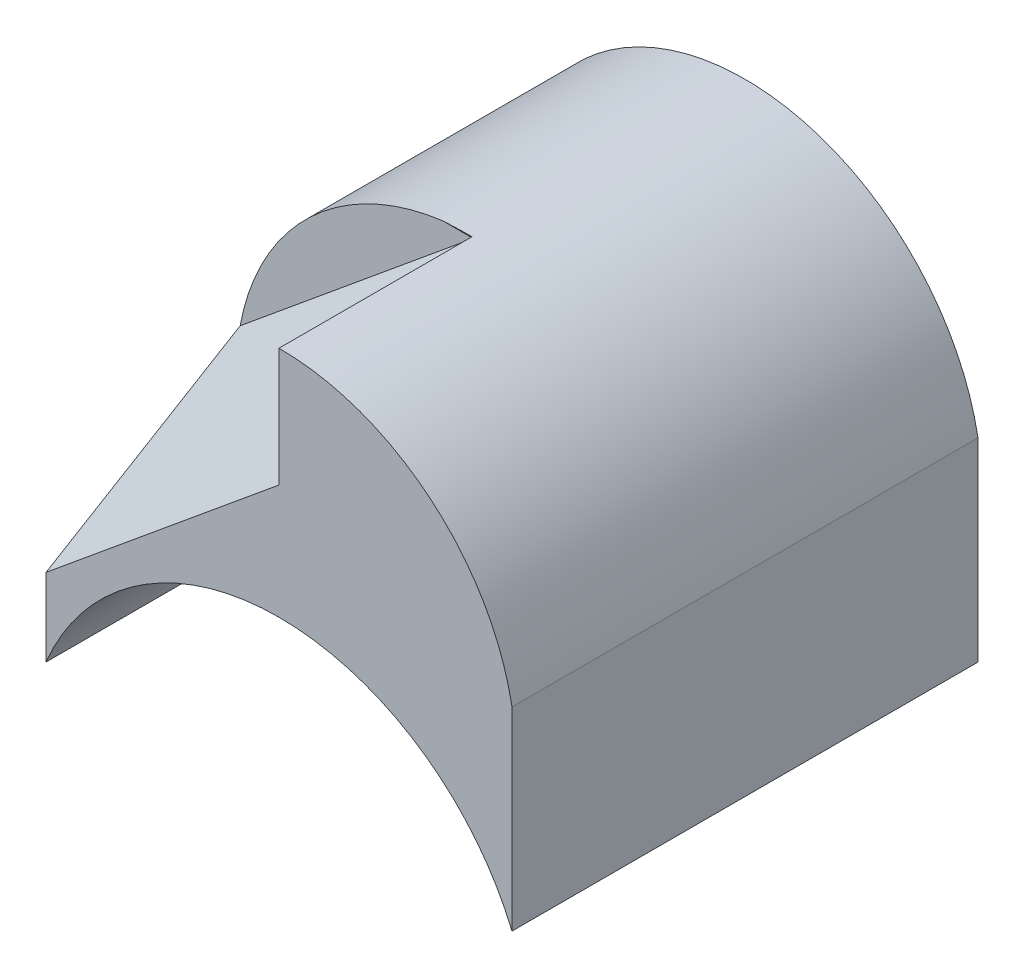
ISO-10303-21;
HEADER;
FILE_DESCRIPTION(('STEP AP214'),'2;1');
FILE_NAME('part.step','',(''),(''),'','','');
FILE_SCHEMA(('AUTOMOTIVE_DESIGN { 1 0 10303 214 1 1 1 1 }'));
ENDSEC;
DATA;
#1=APPLICATION_CONTEXT('core data for automotive mechanical design processes');
#2=APPLICATION_PROTOCOL_DEFINITION('international standard','automotive_design',2000,#1);
#3=PRODUCT_CONTEXT('',#1,'mechanical');
#4=PRODUCT('Part','Part','',(#3));
#5=PRODUCT_RELATED_PRODUCT_CATEGORY('part','',(#4));
#6=PRODUCT_DEFINITION_FORMATION('','',#4);
#7=PRODUCT_DEFINITION_CONTEXT('part definition',#1,'design');
#8=PRODUCT_DEFINITION('design','',#6,#7);
#9=PRODUCT_DEFINITION_SHAPE('','',#8);
#10=(LENGTH_UNIT() NAMED_UNIT(*) SI_UNIT(.MILLI.,.METRE.));
#11=(NAMED_UNIT(*) PLANE_ANGLE_UNIT() SI_UNIT($,.RADIAN.));
#12=(NAMED_UNIT(*) SI_UNIT($,.STERADIAN.) SOLID_ANGLE_UNIT());
#13=UNCERTAINTY_MEASURE_WITH_UNIT(LENGTH_MEASURE(1.E-05),#10,'distance_accuracy_value','');
#14=(GEOMETRIC_REPRESENTATION_CONTEXT(3) GLOBAL_UNCERTAINTY_ASSIGNED_CONTEXT((#13)) GLOBAL_UNIT_ASSIGNED_CONTEXT((#10,
#11,#12)) REPRESENTATION_CONTEXT('',''));
#15=CARTESIAN_POINT('',(0.,0.,0.));
#16=DIRECTION('',(0.,0.,1.));
#17=DIRECTION('',(1.,0.,0.));
#18=AXIS2_PLACEMENT_3D('',#15,#16,#17);
#19=CARTESIAN_POINT('',(-3.,5.,3.));
#20=DIRECTION('',(0.,0.,-1.));
#21=DIRECTION('',(-1.,0.,0.));
#22=AXIS2_PLACEMENT_3D('',#19,#20,#21);
#23=PLANE('',#22);
#24=CARTESIAN_POINT('',(0.,1.95,3.));
#25=DIRECTION('',(0.,0.,1.));
#26=DIRECTION('',(1.,0.,0.));
#27=AXIS2_PLACEMENT_3D('',#24,#25,#26);
#28=CIRCLE('',#27,3.05);
#29=CARTESIAN_POINT('',(0.,5.,3.));
#30=VERTEX_POINT('',#29);
#31=CARTESIAN_POINT('',(3.,2.5,3.));
#32=VERTEX_POINT('',#31);
#33=EDGE_CURVE('E138',#30,#32,#28,.F.);
#34=ORIENTED_EDGE('',*,*,#33,.F.);
#35=DIRECTION('',(0.,-1.,0.));
#36=VECTOR('',#35,1.);
#37=CARTESIAN_POINT('',(0.,5.,3.));
#38=LINE('',#37,#36);
#39=CARTESIAN_POINT('',(0.,3.4749371855331,3.));
#40=VERTEX_POINT('',#39);
#41=EDGE_CURVE('E56',#30,#40,#38,.T.);
#42=ORIENTED_EDGE('',*,*,#41,.T.);
#43=DIRECTION('',(-0.771381206972472,-0.636373344452525,0.));
#44=VECTOR('',#43,1.);
#45=CARTESIAN_POINT('',(0.,3.4749371855331,3.));
#46=LINE('',#45,#44);
#47=CARTESIAN_POINT('',(-3.,1.,3.));
#48=VERTEX_POINT('',#47);
#49=EDGE_CURVE('E177',#40,#48,#46,.T.);
#50=ORIENTED_EDGE('',*,*,#49,.T.);
#51=DIRECTION('',(0.,-1.,0.));
#52=VECTOR('',#51,1.);
#53=CARTESIAN_POINT('',(-3.,5.,3.));
#54=LINE('',#53,#52);
#55=CARTESIAN_POINT('',(-3.,0.,3.));
#56=VERTEX_POINT('',#55);
#57=EDGE_CURVE('E70',#48,#56,#54,.T.);
#58=ORIENTED_EDGE('',*,*,#57,.T.);
#59=CARTESIAN_POINT('',(0.,-1.25,3.));
#60=DIRECTION('',(0.,0.,1.));
#61=DIRECTION('',(1.,0.,0.));
#62=AXIS2_PLACEMENT_3D('',#59,#60,#61);
#63=CIRCLE('',#62,3.25);
#64=CARTESIAN_POINT('',(3.,0.,3.));
#65=VERTEX_POINT('',#64);
#66=EDGE_CURVE('E179',#56,#65,#63,.F.);
#67=ORIENTED_EDGE('',*,*,#66,.T.);
#68=DIRECTION('',(0.,-1.,0.));
#69=VECTOR('',#68,1.);
#70=CARTESIAN_POINT('',(3.,5.,3.));
#71=LINE('',#70,#69);
#72=EDGE_CURVE('E156',#32,#65,#71,.T.);
#73=ORIENTED_EDGE('',*,*,#72,.F.);
#74=EDGE_LOOP('',(#34,#42,#50,#58,#67,#73));
#75=FACE_BOUND('',#74,.T.);
#76=ADVANCED_FACE('F52',(#75),#23,.F.);
#77=CARTESIAN_POINT('',(-3.,5.,3.));
#78=DIRECTION('',(1.,0.,0.));
#79=DIRECTION('',(0.,0.,-1.));
#80=AXIS2_PLACEMENT_3D('',#77,#78,#79);
#81=PLANE('',#80);
#82=DIRECTION('',(0.,0.514495755427526,-0.857492925712545));
#83=VECTOR('',#82,1.);
#84=CARTESIAN_POINT('',(-3.,1.,3.));
#85=LINE('',#84,#83);
#86=CARTESIAN_POINT('',(-3.,2.5,0.5));
#87=VERTEX_POINT('',#86);
#88=EDGE_CURVE('E180',#48,#87,#85,.T.);
#89=ORIENTED_EDGE('',*,*,#88,.T.);
#90=DIRECTION('',(0.,0.,1.));
#91=VECTOR('',#90,1.);
#92=CARTESIAN_POINT('',(-3.,2.5,-9.5));
#93=LINE('',#92,#91);
#94=CARTESIAN_POINT('',(-3.,2.5,-3.));
#95=VERTEX_POINT('',#94);
#96=EDGE_CURVE('E133',#95,#87,#93,.T.);
#97=ORIENTED_EDGE('',*,*,#96,.F.);
#98=DIRECTION('',(0.,-1.,0.));
#99=VECTOR('',#98,1.);
#100=CARTESIAN_POINT('',(-3.,5.,-3.));
#101=LINE('',#100,#99);
#102=CARTESIAN_POINT('',(-3.,0.,-3.));
#103=VERTEX_POINT('',#102);
#104=EDGE_CURVE('E161',#95,#103,#101,.T.);
#105=ORIENTED_EDGE('',*,*,#104,.T.);
#106=DIRECTION('',(0.,0.,1.));
#107=VECTOR('',#106,1.);
#108=CARTESIAN_POINT('',(-3.,0.,3.));
#109=LINE('',#108,#107);
#110=EDGE_CURVE('E153',#103,#56,#109,.T.);
#111=ORIENTED_EDGE('',*,*,#110,.T.);
#112=ORIENTED_EDGE('',*,*,#57,.F.);
#113=EDGE_LOOP('',(#89,#97,#105,#111,#112));
#114=FACE_BOUND('',#113,.T.);
#115=ADVANCED_FACE('F202',(#114),#81,.F.);
#116=CARTESIAN_POINT('',(0.,1.95,-9.5));
#117=DIRECTION('',(0.,0.,1.));
#118=DIRECTION('',(1.,0.,0.));
#119=AXIS2_PLACEMENT_3D('',#116,#117,#118);
#120=CYLINDRICAL_SURFACE('',#119,3.05);
#121=CARTESIAN_POINT('',(0.,1.95,-1.31496231131986));
#122=DIRECTION('',(0.,0.514495755427526,-0.857492925712544));
#123=DIRECTION('',(0.,0.857492925712544,0.514495755427526));
#124=AXIS2_PLACEMENT_3D('',#121,#122,#123);
#125=ELLIPSE('',#124,3.55688065585563,3.05);
#126=CARTESIAN_POINT('',(-0.390198697562011,4.9749371855331,0.500000000000002));
#127=VERTEX_POINT('',#126);
#128=CARTESIAN_POINT('',(0.,5.,0.515037688680142));
#129=VERTEX_POINT('',#128);
#130=EDGE_CURVE('E116',#127,#129,#125,.T.);
#131=ORIENTED_EDGE('',*,*,#130,.T.);
#132=DIRECTION('',(0.,0.,1.));
#133=VECTOR('',#132,1.);
#134=CARTESIAN_POINT('',(0.,5.,-9.5));
#135=LINE('',#134,#133);
#136=EDGE_CURVE('E165',#129,#30,#135,.T.);
#137=ORIENTED_EDGE('',*,*,#136,.T.);
#138=ORIENTED_EDGE('',*,*,#33,.T.);
#139=DIRECTION('',(0.,0.,1.));
#140=VECTOR('',#139,1.);
#141=CARTESIAN_POINT('',(3.,2.5,-9.5));
#142=LINE('',#141,#140);
#143=CARTESIAN_POINT('',(3.,2.5,-3.));
#144=VERTEX_POINT('',#143);
#145=EDGE_CURVE('E62',#144,#32,#142,.T.);
#146=ORIENTED_EDGE('',*,*,#145,.F.);
#147=CARTESIAN_POINT('',(0.,1.95,-3.));
#148=DIRECTION('',(0.,0.,1.));
#149=DIRECTION('',(1.,0.,0.));
#150=AXIS2_PLACEMENT_3D('',#147,#148,#149);
#151=CIRCLE('',#150,3.05);
#152=EDGE_CURVE('E78',#95,#144,#151,.F.);
#153=ORIENTED_EDGE('',*,*,#152,.F.);
#154=ORIENTED_EDGE('',*,*,#96,.T.);
#155=CARTESIAN_POINT('',(0.,1.95,0.5));
#156=DIRECTION('',(0.,0.,1.));
#157=DIRECTION('',(0.,-1.,0.));
#158=AXIS2_PLACEMENT_3D('',#155,#156,#157);
#159=CIRCLE('',#158,3.05);
#160=EDGE_CURVE('E13',#127,#87,#159,.T.);
#161=ORIENTED_EDGE('',*,*,#160,.F.);
#162=EDGE_LOOP('',(#131,#137,#138,#146,#153,#154,#161));
#163=FACE_BOUND('',#162,.T.);
#164=ADVANCED_FACE('F132',(#163),#120,.T.);
#165=CARTESIAN_POINT('',(-3.,5.,-3.));
#166=DIRECTION('',(0.,0.,1.));
#167=DIRECTION('',(1.,0.,0.));
#168=AXIS2_PLACEMENT_3D('',#165,#166,#167);
#169=PLANE('',#168);
#170=ORIENTED_EDGE('',*,*,#152,.T.);
#171=DIRECTION('',(0.,-1.,0.));
#172=VECTOR('',#171,1.);
#173=CARTESIAN_POINT('',(3.,5.,-3.));
#174=LINE('',#173,#172);
#175=CARTESIAN_POINT('',(3.,0.,-3.));
#176=VERTEX_POINT('',#175);
#177=EDGE_CURVE('E197',#144,#176,#174,.T.);
#178=ORIENTED_EDGE('',*,*,#177,.T.);
#179=CARTESIAN_POINT('',(0.,-1.25,-3.));
#180=DIRECTION('',(0.,0.,1.));
#181=DIRECTION('',(1.,0.,0.));
#182=AXIS2_PLACEMENT_3D('',#179,#180,#181);
#183=CIRCLE('',#182,3.25);
#184=EDGE_CURVE('E142',#103,#176,#183,.F.);
#185=ORIENTED_EDGE('',*,*,#184,.F.);
#186=ORIENTED_EDGE('',*,*,#104,.F.);
#187=EDGE_LOOP('',(#170,#178,#185,#186));
#188=FACE_BOUND('',#187,.T.);
#189=ADVANCED_FACE('F198',(#188),#169,.F.);
#190=CARTESIAN_POINT('',(3.,5.,3.));
#191=DIRECTION('',(-1.,0.,0.));
#192=DIRECTION('',(0.,0.,1.));
#193=AXIS2_PLACEMENT_3D('',#190,#191,#192);
#194=PLANE('',#193);
#195=ORIENTED_EDGE('',*,*,#177,.F.);
#196=ORIENTED_EDGE('',*,*,#145,.T.);
#197=ORIENTED_EDGE('',*,*,#72,.T.);
#198=DIRECTION('',(0.,0.,-1.));
#199=VECTOR('',#198,1.);
#200=CARTESIAN_POINT('',(3.,0.,3.));
#201=LINE('',#200,#199);
#202=EDGE_CURVE('E140',#65,#176,#201,.T.);
#203=ORIENTED_EDGE('',*,*,#202,.T.);
#204=EDGE_LOOP('',(#195,#196,#197,#203));
#205=FACE_BOUND('',#204,.T.);
#206=ADVANCED_FACE('F54',(#205),#194,.F.);
#207=CARTESIAN_POINT('',(0.,-1.25,-9.5));
#208=DIRECTION('',(0.,0.,1.));
#209=DIRECTION('',(1.,0.,0.));
#210=AXIS2_PLACEMENT_3D('',#207,#208,#209);
#211=CYLINDRICAL_SURFACE('',#210,3.25);
#212=ORIENTED_EDGE('',*,*,#184,.T.);
#213=ORIENTED_EDGE('',*,*,#202,.F.);
#214=ORIENTED_EDGE('',*,*,#66,.F.);
#215=ORIENTED_EDGE('',*,*,#110,.F.);
#216=EDGE_LOOP('',(#212,#213,#214,#215));
#217=FACE_BOUND('',#216,.T.);
#218=ADVANCED_FACE('F194',(#217),#211,.F.);
#219=CARTESIAN_POINT('',(-3.,2.5,0.5));
#220=DIRECTION('',(0.,0.,1.));
#221=DIRECTION('',(0.,-1.,0.));
#222=AXIS2_PLACEMENT_3D('',#219,#220,#221);
#223=PLANE('',#222);
#224=ORIENTED_EDGE('',*,*,#160,.T.);
#225=DIRECTION('',(0.771381206972472,0.636373344452525,0.));
#226=VECTOR('',#225,1.);
#227=CARTESIAN_POINT('',(-3.,2.5,0.5));
#228=LINE('',#227,#226);
#229=CARTESIAN_POINT('',(0.,4.9749371855331,0.5));
#230=VERTEX_POINT('',#229);
#231=EDGE_CURVE('E129',#87,#230,#228,.T.);
#232=ORIENTED_EDGE('',*,*,#231,.T.);
#233=DIRECTION('',(-1.,0.,0.));
#234=VECTOR('',#233,1.);
#235=CARTESIAN_POINT('',(0.,4.9749371855331,0.5));
#236=LINE('',#235,#234);
#237=EDGE_CURVE('E119',#230,#127,#236,.T.);
#238=ORIENTED_EDGE('',*,*,#237,.T.);
#239=EDGE_LOOP('',(#224,#232,#238));
#240=FACE_BOUND('',#239,.T.);
#241=ADVANCED_FACE('F127',(#240),#223,.T.);
#242=CARTESIAN_POINT('',(-2.1325752677696,2.58500532486473,1.55100319491884));
#243=DIRECTION('',(-0.577517303487475,0.700038740615242,0.420023244369145));
#244=DIRECTION('',(-0.771381206972471,-0.636373344452526,0.));
#245=AXIS2_PLACEMENT_3D('',#242,#243,#244);
#246=PLANE('',#245);
#247=ORIENTED_EDGE('',*,*,#49,.F.);
#248=DIRECTION('',(0.,-0.514495755427526,0.857492925712544));
#249=VECTOR('',#248,1.);
#250=CARTESIAN_POINT('',(0.,4.9749371855331,0.5));
#251=LINE('',#250,#249);
#252=EDGE_CURVE('E130',#230,#40,#251,.T.);
#253=ORIENTED_EDGE('',*,*,#252,.F.);
#254=ORIENTED_EDGE('',*,*,#231,.F.);
#255=ORIENTED_EDGE('',*,*,#88,.F.);
#256=EDGE_LOOP('',(#247,#253,#254,#255));
#257=FACE_BOUND('',#256,.T.);
#258=ADVANCED_FACE('F205',(#257),#246,.T.);
#259=CARTESIAN_POINT('',(-0.390198697562011,13.5498664426585,5.64495755427527));
#260=DIRECTION('',(0.,0.514495755427526,-0.857492925712544));
#261=DIRECTION('',(0.,0.857492925712544,0.514495755427526));
#262=AXIS2_PLACEMENT_3D('',#259,#260,#261);
#263=PLANE('',#262);
#264=ORIENTED_EDGE('',*,*,#237,.F.);
#265=DIRECTION('',(0.,-0.857492925712544,-0.514495755427526));
#266=VECTOR('',#265,1.);
#267=CARTESIAN_POINT('',(0.,13.5498664426585,5.64495755427526));
#268=LINE('',#267,#266);
#269=EDGE_CURVE('E121',#129,#230,#268,.T.);
#270=ORIENTED_EDGE('',*,*,#269,.F.);
#271=ORIENTED_EDGE('',*,*,#130,.F.);
#272=EDGE_LOOP('',(#264,#270,#271));
#273=FACE_BOUND('',#272,.T.);
#274=ADVANCED_FACE('F118',(#273),#263,.F.);
#275=CARTESIAN_POINT('',(0.,13.5498664426585,5.64495755427526));
#276=DIRECTION('',(1.,0.,0.));
#277=DIRECTION('',(0.,0.,-1.));
#278=AXIS2_PLACEMENT_3D('',#275,#276,#277);
#279=PLANE('',#278);
#280=ORIENTED_EDGE('',*,*,#136,.F.);
#281=ORIENTED_EDGE('',*,*,#269,.T.);
#282=ORIENTED_EDGE('',*,*,#252,.T.);
#283=ORIENTED_EDGE('',*,*,#41,.F.);
#284=EDGE_LOOP('',(#280,#281,#282,#283));
#285=FACE_BOUND('',#284,.T.);
#286=ADVANCED_FACE('F206',(#285),#279,.F.);
#287=CLOSED_SHELL('',(#76,#115,#164,#189,#206,#218,#241,#258,#274,#286));
#288=MANIFOLD_SOLID_BREP('B2',#287);
#289=ADVANCED_BREP_SHAPE_REPRESENTATION('',(#18,#288),#14);
#290=SHAPE_DEFINITION_REPRESENTATION(#9,#289);
ENDSEC;
END-ISO-10303-21;
